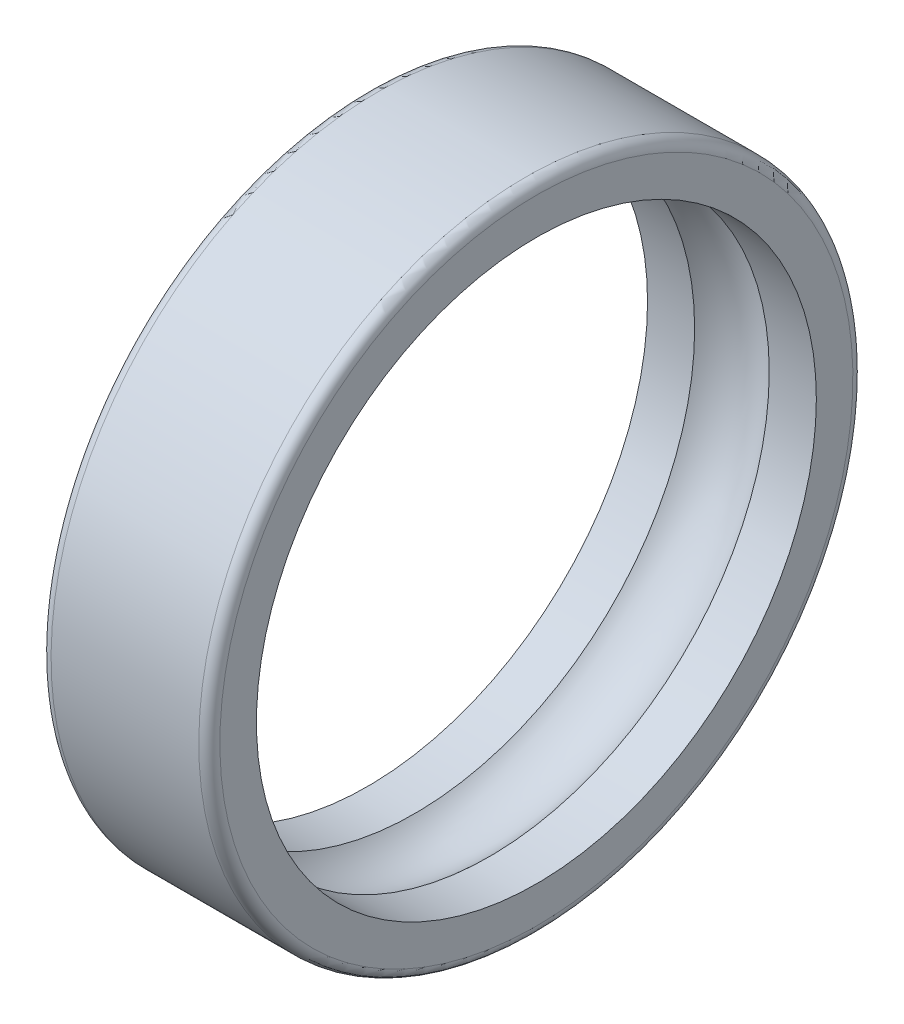
ISO-10303-21;
HEADER;
FILE_DESCRIPTION(('STEP AP214'),'2;1');
FILE_NAME('part.step','',(''),(''),'','','');
FILE_SCHEMA(('AUTOMOTIVE_DESIGN { 1 0 10303 214 1 1 1 1 }'));
ENDSEC;
DATA;
#1=APPLICATION_CONTEXT('core data for automotive mechanical design processes');
#2=APPLICATION_PROTOCOL_DEFINITION('international standard','automotive_design',2000,#1);
#3=PRODUCT_CONTEXT('',#1,'mechanical');
#4=PRODUCT('Part','Part','',(#3));
#5=PRODUCT_RELATED_PRODUCT_CATEGORY('part','',(#4));
#6=PRODUCT_DEFINITION_FORMATION('','',#4);
#7=PRODUCT_DEFINITION_CONTEXT('part definition',#1,'design');
#8=PRODUCT_DEFINITION('design','',#6,#7);
#9=PRODUCT_DEFINITION_SHAPE('','',#8);
#10=(LENGTH_UNIT() NAMED_UNIT(*) SI_UNIT(.MILLI.,.METRE.));
#11=(NAMED_UNIT(*) PLANE_ANGLE_UNIT() SI_UNIT($,.RADIAN.));
#12=(NAMED_UNIT(*) SI_UNIT($,.STERADIAN.) SOLID_ANGLE_UNIT());
#13=UNCERTAINTY_MEASURE_WITH_UNIT(LENGTH_MEASURE(1.E-05),#10,'distance_accuracy_value','');
#14=(GEOMETRIC_REPRESENTATION_CONTEXT(3) GLOBAL_UNCERTAINTY_ASSIGNED_CONTEXT((#13)) GLOBAL_UNIT_ASSIGNED_CONTEXT((#10,
#11,#12)) REPRESENTATION_CONTEXT('',''));
#15=CARTESIAN_POINT('',(0.,0.,0.));
#16=DIRECTION('',(0.,0.,1.));
#17=DIRECTION('',(1.,0.,0.));
#18=AXIS2_PLACEMENT_3D('',#15,#16,#17);
#19=CARTESIAN_POINT('',(72.9943089574791,0.,0.));
#20=DIRECTION('',(-1.,0.,0.));
#21=DIRECTION('',(0.,0.877582561890372,-0.479425538604204));
#22=AXIS2_PLACEMENT_3D('',#19,#20,#21);
#23=TOROIDAL_SURFACE('',#22,23.,5.);
#24=CARTESIAN_POINT('',(69.4587750515691,0.,0.));
#25=DIRECTION('',(1.,0.,0.));
#26=DIRECTION('',(0.,0.,-1.));
#27=AXIS2_PLACEMENT_3D('',#24,#25,#26);
#28=CIRCLE('',#27,26.5355339059);
#29=CARTESIAN_POINT('',(69.4587750515691,0.,-26.5355339059));
#30=VERTEX_POINT('',#29);
#31=EDGE_CURVE('E151',#30,#30,#28,.F.);
#32=ORIENTED_EDGE('',*,*,#31,.T.);
#33=EDGE_LOOP('',(#32));
#34=FACE_BOUND('',#33,.T.);
#35=CARTESIAN_POINT('',(76.5298428634091,0.,0.));
#36=DIRECTION('',(1.,0.,0.));
#37=DIRECTION('',(0.,0.,-1.));
#38=AXIS2_PLACEMENT_3D('',#35,#36,#37);
#39=CIRCLE('',#38,26.5355339059);
#40=CARTESIAN_POINT('',(76.5298428634091,0.,-26.5355339059));
#41=VERTEX_POINT('',#40);
#42=EDGE_CURVE('E148',#41,#41,#39,.T.);
#43=ORIENTED_EDGE('',*,*,#42,.T.);
#44=EDGE_LOOP('',(#43));
#45=FACE_BOUND('',#44,.T.);
#46=ADVANCED_FACE('F17',(#34,#45),#23,.F.);
#47=CARTESIAN_POINT('',(72.9943089573691,0.,0.));
#48=DIRECTION('',(1.,0.,0.));
#49=DIRECTION('',(0.,0.,-1.));
#50=AXIS2_PLACEMENT_3D('',#47,#48,#49);
#51=CYLINDRICAL_SURFACE('',#50,26.5355339059);
#52=CARTESIAN_POINT('',(64.9943089574691,0.,0.));
#53=DIRECTION('',(1.,0.,0.));
#54=DIRECTION('',(0.,0.,-1.));
#55=AXIS2_PLACEMENT_3D('',#52,#53,#54);
#56=CIRCLE('',#55,26.5355339059);
#57=CARTESIAN_POINT('',(64.9943089574691,0.,-26.5355339059));
#58=VERTEX_POINT('',#57);
#59=EDGE_CURVE('E54',#58,#58,#56,.T.);
#60=ORIENTED_EDGE('',*,*,#59,.F.);
#61=EDGE_LOOP('',(#60));
#62=FACE_BOUND('',#61,.T.);
#63=ORIENTED_EDGE('',*,*,#31,.F.);
#64=EDGE_LOOP('',(#63));
#65=FACE_BOUND('',#64,.T.);
#66=ADVANCED_FACE('F85',(#62,#65),#51,.F.);
#67=CARTESIAN_POINT('',(72.9943089573691,0.,0.));
#68=DIRECTION('',(1.,0.,0.));
#69=DIRECTION('',(0.,0.,-1.));
#70=AXIS2_PLACEMENT_3D('',#67,#68,#69);
#71=CYLINDRICAL_SURFACE('',#70,26.5355339059);
#72=ORIENTED_EDGE('',*,*,#42,.F.);
#73=EDGE_LOOP('',(#72));
#74=FACE_BOUND('',#73,.T.);
#75=CARTESIAN_POINT('',(80.9943089574791,0.,0.));
#76=DIRECTION('',(1.,0.,0.));
#77=DIRECTION('',(0.,0.,-1.));
#78=AXIS2_PLACEMENT_3D('',#75,#76,#77);
#79=CIRCLE('',#78,26.5355339059);
#80=CARTESIAN_POINT('',(80.9943089574791,0.,-26.5355339059));
#81=VERTEX_POINT('',#80);
#82=EDGE_CURVE('E60',#81,#81,#79,.T.);
#83=ORIENTED_EDGE('',*,*,#82,.T.);
#84=EDGE_LOOP('',(#83));
#85=FACE_BOUND('',#84,.T.);
#86=ADVANCED_FACE('F79',(#74,#85),#71,.F.);
#87=CARTESIAN_POINT('',(64.9943089574691,30.,0.));
#88=DIRECTION('',(-1.,0.,0.));
#89=DIRECTION('',(0.,0.,1.));
#90=AXIS2_PLACEMENT_3D('',#87,#88,#89);
#91=PLANE('',#90);
#92=ORIENTED_EDGE('',*,*,#59,.T.);
#93=EDGE_LOOP('',(#92));
#94=FACE_BOUND('',#93,.T.);
#95=CARTESIAN_POINT('',(64.9943089574691,0.,0.));
#96=DIRECTION('',(1.,0.,0.));
#97=DIRECTION('',(0.,-0.877582561890572,0.479425538603838));
#98=AXIS2_PLACEMENT_3D('',#95,#96,#97);
#99=CIRCLE('',#98,30.);
#100=CARTESIAN_POINT('',(64.9943089574691,-26.3274768567107,14.3827661581201));
#101=VERTEX_POINT('',#100);
#102=CARTESIAN_POINT('',(64.9943089574691,26.3274768567028,-14.3827661581135));
#103=VERTEX_POINT('',#102);
#104=EDGE_CURVE('E45',#101,#103,#99,.T.);
#105=ORIENTED_EDGE('',*,*,#104,.F.);
#106=CARTESIAN_POINT('',(64.9943089574691,0.,0.));
#107=DIRECTION('',(1.,0.,0.));
#108=DIRECTION('',(0.,0.877582561890373,-0.479425538604203));
#109=AXIS2_PLACEMENT_3D('',#106,#107,#108);
#110=CIRCLE('',#109,29.9999999999888);
#111=EDGE_CURVE('E50',#103,#101,#110,.T.);
#112=ORIENTED_EDGE('',*,*,#111,.F.);
#113=EDGE_LOOP('',(#105,#112));
#114=FACE_BOUND('',#113,.T.);
#115=ADVANCED_FACE('F58',(#94,#114),#91,.T.);
#116=CARTESIAN_POINT('',(80.9943089574791,26.5355339059,0.));
#117=DIRECTION('',(-1.,0.,0.));
#118=DIRECTION('',(0.,0.,1.));
#119=AXIS2_PLACEMENT_3D('',#116,#117,#118);
#120=PLANE('',#119);
#121=ORIENTED_EDGE('',*,*,#82,.F.);
#122=EDGE_LOOP('',(#121));
#123=FACE_BOUND('',#122,.T.);
#124=CARTESIAN_POINT('',(80.9943089574791,0.,0.));
#125=DIRECTION('',(-1.,0.,0.));
#126=DIRECTION('',(0.,0.877582561890372,-0.479425538604204));
#127=AXIS2_PLACEMENT_3D('',#124,#125,#126);
#128=CIRCLE('',#127,30.);
#129=CARTESIAN_POINT('',(80.9943089574791,26.3274768567092,-14.382766158125));
#130=VERTEX_POINT('',#129);
#131=CARTESIAN_POINT('',(80.9943089574791,-26.3274768567105,14.382766158104));
#132=VERTEX_POINT('',#131);
#133=EDGE_CURVE('E35',#130,#132,#128,.T.);
#134=ORIENTED_EDGE('',*,*,#133,.F.);
#135=CARTESIAN_POINT('',(80.9943089574791,0.,0.));
#136=DIRECTION('',(-1.,0.,0.));
#137=DIRECTION('',(0.,-0.877582561890772,0.479425538603472));
#138=AXIS2_PLACEMENT_3D('',#135,#136,#137);
#139=CIRCLE('',#138,29.9999999999888);
#140=EDGE_CURVE('E59',#132,#130,#139,.T.);
#141=ORIENTED_EDGE('',*,*,#140,.F.);
#142=EDGE_LOOP('',(#134,#141));
#143=FACE_BOUND('',#142,.T.);
#144=ADVANCED_FACE('F78',(#123,#143),#120,.F.);
#145=CARTESIAN_POINT('',(65.9943089574691,0.,0.));
#146=DIRECTION('',(-1.,0.,0.));
#147=DIRECTION('',(0.,0.877582561890372,-0.479425538604204));
#148=AXIS2_PLACEMENT_3D('',#145,#146,#147);
#149=TOROIDAL_SURFACE('',#148,30.,1.);
#150=ORIENTED_EDGE('',*,*,#104,.T.);
#151=ORIENTED_EDGE('',*,*,#111,.T.);
#152=EDGE_LOOP('',(#150,#151));
#153=FACE_BOUND('',#152,.T.);
#154=CARTESIAN_POINT('',(65.9943089574691,0.,0.));
#155=DIRECTION('',(1.,0.,0.));
#156=DIRECTION('',(0.,0.,-1.));
#157=AXIS2_PLACEMENT_3D('',#154,#155,#156);
#158=CIRCLE('',#157,31.);
#159=CARTESIAN_POINT('',(65.9943089574691,0.,-31.));
#160=VERTEX_POINT('',#159);
#161=EDGE_CURVE('E29',#160,#160,#158,.T.);
#162=ORIENTED_EDGE('',*,*,#161,.F.);
#163=EDGE_LOOP('',(#162));
#164=FACE_BOUND('',#163,.T.);
#165=ADVANCED_FACE('F48',(#153,#164),#149,.T.);
#166=CARTESIAN_POINT('',(79.9943089574791,0.,0.));
#167=DIRECTION('',(-1.,0.,0.));
#168=DIRECTION('',(0.,0.877582561890372,-0.479425538604204));
#169=AXIS2_PLACEMENT_3D('',#166,#167,#168);
#170=TOROIDAL_SURFACE('',#169,30.,1.);
#171=ORIENTED_EDGE('',*,*,#140,.T.);
#172=ORIENTED_EDGE('',*,*,#133,.T.);
#173=EDGE_LOOP('',(#171,#172));
#174=FACE_BOUND('',#173,.T.);
#175=CARTESIAN_POINT('',(79.9943089574791,0.,0.));
#176=DIRECTION('',(1.,0.,0.));
#177=DIRECTION('',(0.,0.,-1.));
#178=AXIS2_PLACEMENT_3D('',#175,#176,#177);
#179=CIRCLE('',#178,31.);
#180=CARTESIAN_POINT('',(79.9943089574791,0.,-31.));
#181=VERTEX_POINT('',#180);
#182=EDGE_CURVE('E11',#181,#181,#179,.F.);
#183=ORIENTED_EDGE('',*,*,#182,.F.);
#184=EDGE_LOOP('',(#183));
#185=FACE_BOUND('',#184,.T.);
#186=ADVANCED_FACE('F98',(#174,#185),#170,.T.);
#187=CARTESIAN_POINT('',(72.9943089573691,0.,0.));
#188=DIRECTION('',(1.,0.,0.));
#189=DIRECTION('',(0.,0.,-1.));
#190=AXIS2_PLACEMENT_3D('',#187,#188,#189);
#191=CYLINDRICAL_SURFACE('',#190,31.);
#192=ORIENTED_EDGE('',*,*,#161,.T.);
#193=EDGE_LOOP('',(#192));
#194=FACE_BOUND('',#193,.T.);
#195=ORIENTED_EDGE('',*,*,#182,.T.);
#196=EDGE_LOOP('',(#195));
#197=FACE_BOUND('',#196,.T.);
#198=ADVANCED_FACE('F96',(#194,#197),#191,.T.);
#199=CLOSED_SHELL('',(#46,#66,#86,#115,#144,#165,#186,#198));
#200=MANIFOLD_SOLID_BREP('B1',#199);
#201=ADVANCED_BREP_SHAPE_REPRESENTATION('',(#18,#200),#14);
#202=SHAPE_DEFINITION_REPRESENTATION(#9,#201);
ENDSEC;
END-ISO-10303-21;
